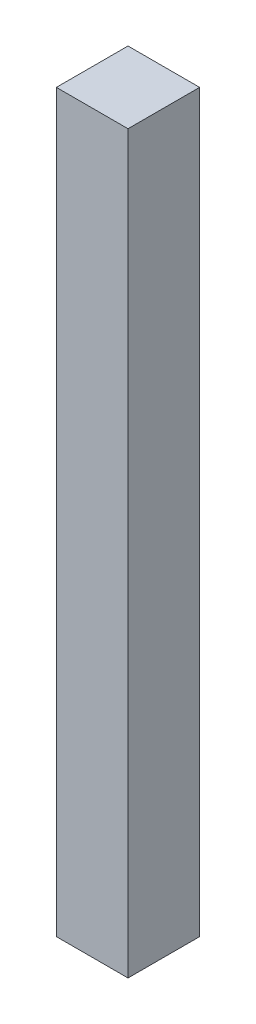
ISO-10303-21;
HEADER;
FILE_DESCRIPTION(('STEP AP214'),'2;1');
FILE_NAME('part.step','',(''),(''),'','','');
FILE_SCHEMA(('AUTOMOTIVE_DESIGN { 1 0 10303 214 1 1 1 1 }'));
ENDSEC;
DATA;
#1=APPLICATION_CONTEXT('core data for automotive mechanical design processes');
#2=APPLICATION_PROTOCOL_DEFINITION('international standard','automotive_design',2000,#1);
#3=PRODUCT_CONTEXT('',#1,'mechanical');
#4=PRODUCT('Part','Part','',(#3));
#5=PRODUCT_RELATED_PRODUCT_CATEGORY('part','',(#4));
#6=PRODUCT_DEFINITION_FORMATION('','',#4);
#7=PRODUCT_DEFINITION_CONTEXT('part definition',#1,'design');
#8=PRODUCT_DEFINITION('design','',#6,#7);
#9=PRODUCT_DEFINITION_SHAPE('','',#8);
#10=(LENGTH_UNIT() NAMED_UNIT(*) SI_UNIT(.MILLI.,.METRE.));
#11=(NAMED_UNIT(*) PLANE_ANGLE_UNIT() SI_UNIT($,.RADIAN.));
#12=(NAMED_UNIT(*) SI_UNIT($,.STERADIAN.) SOLID_ANGLE_UNIT());
#13=UNCERTAINTY_MEASURE_WITH_UNIT(LENGTH_MEASURE(1.E-05),#10,'distance_accuracy_value','');
#14=(GEOMETRIC_REPRESENTATION_CONTEXT(3) GLOBAL_UNCERTAINTY_ASSIGNED_CONTEXT((#13)) GLOBAL_UNIT_ASSIGNED_CONTEXT((#10,
#11,#12)) REPRESENTATION_CONTEXT('',''));
#15=CARTESIAN_POINT('',(0.,0.,0.));
#16=DIRECTION('',(0.,0.,1.));
#17=DIRECTION('',(1.,0.,0.));
#18=AXIS2_PLACEMENT_3D('',#15,#16,#17);
#19=CARTESIAN_POINT('',(-39.8355089835924,260.8,-18.6136158048334));
#20=DIRECTION('',(1.,0.,0.));
#21=DIRECTION('',(0.,0.,-1.));
#22=AXIS2_PLACEMENT_3D('',#19,#20,#21);
#23=PLANE('',#22);
#24=DIRECTION('',(0.,0.,1.));
#25=VECTOR('',#24,1.);
#26=CARTESIAN_POINT('',(-39.8355089835924,0.,-18.6136158048334));
#27=LINE('',#26,#25);
#28=CARTESIAN_POINT('',(-39.8355089835924,0.,-18.6136158048334));
#29=VERTEX_POINT('',#28);
#30=CARTESIAN_POINT('',(-39.8355089835924,0.,6.78638419516663));
#31=VERTEX_POINT('',#30);
#32=EDGE_CURVE('E94',#29,#31,#27,.T.);
#33=ORIENTED_EDGE('',*,*,#32,.T.);
#34=DIRECTION('',(0.,-1.,0.));
#35=VECTOR('',#34,1.);
#36=CARTESIAN_POINT('',(-39.8355089835924,260.8,6.78638419516663));
#37=LINE('',#36,#35);
#38=CARTESIAN_POINT('',(-39.8355089835924,260.8,6.78638419516663));
#39=VERTEX_POINT('',#38);
#40=EDGE_CURVE('E11',#39,#31,#37,.T.);
#41=ORIENTED_EDGE('',*,*,#40,.F.);
#42=DIRECTION('',(0.,0.,1.));
#43=VECTOR('',#42,1.);
#44=CARTESIAN_POINT('',(-39.8355089835924,260.8,-18.6136158048334));
#45=LINE('',#44,#43);
#46=CARTESIAN_POINT('',(-39.8355089835924,260.8,-18.6136158048334));
#47=VERTEX_POINT('',#46);
#48=EDGE_CURVE('E82',#47,#39,#45,.T.);
#49=ORIENTED_EDGE('',*,*,#48,.F.);
#50=DIRECTION('',(0.,-1.,0.));
#51=VECTOR('',#50,1.);
#52=CARTESIAN_POINT('',(-39.8355089835924,260.8,-18.6136158048334));
#53=LINE('',#52,#51);
#54=EDGE_CURVE('E90',#47,#29,#53,.T.);
#55=ORIENTED_EDGE('',*,*,#54,.T.);
#56=EDGE_LOOP('',(#33,#41,#49,#55));
#57=FACE_BOUND('',#56,.T.);
#58=ADVANCED_FACE('F31',(#57),#23,.F.);
#59=CARTESIAN_POINT('',(-39.8355089835924,260.8,6.78638419516663));
#60=DIRECTION('',(0.,0.,-1.));
#61=DIRECTION('',(-1.,0.,0.));
#62=AXIS2_PLACEMENT_3D('',#59,#60,#61);
#63=PLANE('',#62);
#64=DIRECTION('',(1.,0.,0.));
#65=VECTOR('',#64,1.);
#66=CARTESIAN_POINT('',(-39.8355089835924,0.,6.78638419516663));
#67=LINE('',#66,#65);
#68=CARTESIAN_POINT('',(-14.4355089835924,0.,6.78638419516663));
#69=VERTEX_POINT('',#68);
#70=EDGE_CURVE('E86',#31,#69,#67,.T.);
#71=ORIENTED_EDGE('',*,*,#70,.T.);
#72=DIRECTION('',(0.,-1.,0.));
#73=VECTOR('',#72,1.);
#74=CARTESIAN_POINT('',(-14.4355089835924,260.8,6.78638419516663));
#75=LINE('',#74,#73);
#76=CARTESIAN_POINT('',(-14.4355089835924,260.8,6.78638419516663));
#77=VERTEX_POINT('',#76);
#78=EDGE_CURVE('E39',#77,#69,#75,.T.);
#79=ORIENTED_EDGE('',*,*,#78,.F.);
#80=DIRECTION('',(1.,0.,0.));
#81=VECTOR('',#80,1.);
#82=CARTESIAN_POINT('',(-39.8355089835924,260.8,6.78638419516663));
#83=LINE('',#82,#81);
#84=EDGE_CURVE('E77',#39,#77,#83,.T.);
#85=ORIENTED_EDGE('',*,*,#84,.F.);
#86=ORIENTED_EDGE('',*,*,#40,.T.);
#87=EDGE_LOOP('',(#71,#79,#85,#86));
#88=FACE_BOUND('',#87,.T.);
#89=ADVANCED_FACE('F85',(#88),#63,.F.);
#90=CARTESIAN_POINT('',(-14.4355089835924,260.8,-18.6136158048334));
#91=DIRECTION('',(-1.,0.,0.));
#92=DIRECTION('',(0.,0.,1.));
#93=AXIS2_PLACEMENT_3D('',#90,#91,#92);
#94=PLANE('',#93);
#95=DIRECTION('',(0.,0.,-1.));
#96=VECTOR('',#95,1.);
#97=CARTESIAN_POINT('',(-14.4355089835924,0.,-18.6136158048334));
#98=LINE('',#97,#96);
#99=CARTESIAN_POINT('',(-14.4355089835924,0.,-18.6136158048334));
#100=VERTEX_POINT('',#99);
#101=EDGE_CURVE('E64',#69,#100,#98,.T.);
#102=ORIENTED_EDGE('',*,*,#101,.T.);
#103=DIRECTION('',(0.,-1.,0.));
#104=VECTOR('',#103,1.);
#105=CARTESIAN_POINT('',(-14.4355089835924,260.8,-18.6136158048334));
#106=LINE('',#105,#104);
#107=CARTESIAN_POINT('',(-14.4355089835924,260.8,-18.6136158048334));
#108=VERTEX_POINT('',#107);
#109=EDGE_CURVE('E87',#108,#100,#106,.T.);
#110=ORIENTED_EDGE('',*,*,#109,.F.);
#111=DIRECTION('',(0.,0.,-1.));
#112=VECTOR('',#111,1.);
#113=CARTESIAN_POINT('',(-14.4355089835924,260.8,-18.6136158048334));
#114=LINE('',#113,#112);
#115=EDGE_CURVE('E80',#77,#108,#114,.T.);
#116=ORIENTED_EDGE('',*,*,#115,.F.);
#117=ORIENTED_EDGE('',*,*,#78,.T.);
#118=EDGE_LOOP('',(#102,#110,#116,#117));
#119=FACE_BOUND('',#118,.T.);
#120=ADVANCED_FACE('F88',(#119),#94,.F.);
#121=CARTESIAN_POINT('',(-39.8355089835924,260.8,-18.6136158048334));
#122=DIRECTION('',(0.,0.,1.));
#123=DIRECTION('',(1.,0.,0.));
#124=AXIS2_PLACEMENT_3D('',#121,#122,#123);
#125=PLANE('',#124);
#126=DIRECTION('',(-1.,0.,0.));
#127=VECTOR('',#126,1.);
#128=CARTESIAN_POINT('',(-39.8355089835924,0.,-18.6136158048334));
#129=LINE('',#128,#127);
#130=EDGE_CURVE('E70',#100,#29,#129,.T.);
#131=ORIENTED_EDGE('',*,*,#130,.T.);
#132=ORIENTED_EDGE('',*,*,#54,.F.);
#133=DIRECTION('',(-1.,0.,0.));
#134=VECTOR('',#133,1.);
#135=CARTESIAN_POINT('',(-39.8355089835924,260.8,-18.6136158048334));
#136=LINE('',#135,#134);
#137=EDGE_CURVE('E47',#108,#47,#136,.T.);
#138=ORIENTED_EDGE('',*,*,#137,.F.);
#139=ORIENTED_EDGE('',*,*,#109,.T.);
#140=EDGE_LOOP('',(#131,#132,#138,#139));
#141=FACE_BOUND('',#140,.T.);
#142=ADVANCED_FACE('F101',(#141),#125,.F.);
#143=CARTESIAN_POINT('',(-39.8355089835924,260.8,6.78638419516663));
#144=DIRECTION('',(0.,1.,0.));
#145=DIRECTION('',(0.,0.,1.));
#146=AXIS2_PLACEMENT_3D('',#143,#144,#145);
#147=PLANE('',#146);
#148=ORIENTED_EDGE('',*,*,#48,.T.);
#149=ORIENTED_EDGE('',*,*,#84,.T.);
#150=ORIENTED_EDGE('',*,*,#115,.T.);
#151=ORIENTED_EDGE('',*,*,#137,.T.);
#152=EDGE_LOOP('',(#148,#149,#150,#151));
#153=FACE_BOUND('',#152,.T.);
#154=ADVANCED_FACE('F78',(#153),#147,.T.);
#155=CARTESIAN_POINT('',(-39.8355089835924,0.,6.78638419516663));
#156=DIRECTION('',(0.,1.,0.));
#157=DIRECTION('',(0.,0.,1.));
#158=AXIS2_PLACEMENT_3D('',#155,#156,#157);
#159=PLANE('',#158);
#160=ORIENTED_EDGE('',*,*,#32,.F.);
#161=ORIENTED_EDGE('',*,*,#130,.F.);
#162=ORIENTED_EDGE('',*,*,#101,.F.);
#163=ORIENTED_EDGE('',*,*,#70,.F.);
#164=EDGE_LOOP('',(#160,#161,#162,#163));
#165=FACE_BOUND('',#164,.T.);
#166=ADVANCED_FACE('F104',(#165),#159,.F.);
#167=CLOSED_SHELL('',(#58,#89,#120,#142,#154,#166));
#168=MANIFOLD_SOLID_BREP('B2',#167);
#169=ADVANCED_BREP_SHAPE_REPRESENTATION('',(#18,#168),#14);
#170=SHAPE_DEFINITION_REPRESENTATION(#9,#169);
ENDSEC;
END-ISO-10303-21;
